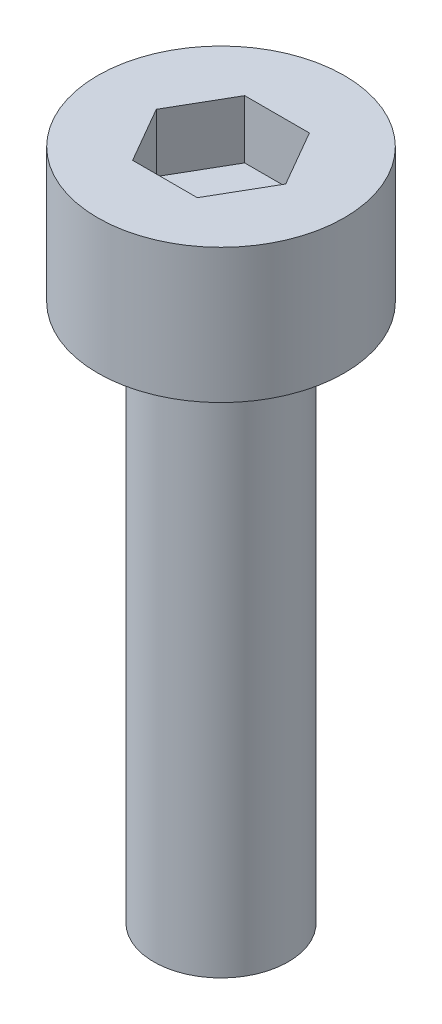
ISO-10303-21;
HEADER;
FILE_DESCRIPTION(('STEP AP214'),'2;1');
FILE_NAME('part.step','',(''),(''),'','','');
FILE_SCHEMA(('AUTOMOTIVE_DESIGN { 1 0 10303 214 1 1 1 1 }'));
ENDSEC;
DATA;
#1=APPLICATION_CONTEXT('core data for automotive mechanical design processes');
#2=APPLICATION_PROTOCOL_DEFINITION('international standard','automotive_design',2000,#1);
#3=PRODUCT_CONTEXT('',#1,'mechanical');
#4=PRODUCT('Part','Part','',(#3));
#5=PRODUCT_RELATED_PRODUCT_CATEGORY('part','',(#4));
#6=PRODUCT_DEFINITION_FORMATION('','',#4);
#7=PRODUCT_DEFINITION_CONTEXT('part definition',#1,'design');
#8=PRODUCT_DEFINITION('design','',#6,#7);
#9=PRODUCT_DEFINITION_SHAPE('','',#8);
#10=(LENGTH_UNIT() NAMED_UNIT(*) SI_UNIT(.MILLI.,.METRE.));
#11=(NAMED_UNIT(*) PLANE_ANGLE_UNIT() SI_UNIT($,.RADIAN.));
#12=(NAMED_UNIT(*) SI_UNIT($,.STERADIAN.) SOLID_ANGLE_UNIT());
#13=UNCERTAINTY_MEASURE_WITH_UNIT(LENGTH_MEASURE(1.E-05),#10,'distance_accuracy_value','');
#14=(GEOMETRIC_REPRESENTATION_CONTEXT(3) GLOBAL_UNCERTAINTY_ASSIGNED_CONTEXT((#13)) GLOBAL_UNIT_ASSIGNED_CONTEXT((#10,
#11,#12)) REPRESENTATION_CONTEXT('',''));
#15=CARTESIAN_POINT('',(0.,0.,0.));
#16=DIRECTION('',(0.,0.,1.));
#17=DIRECTION('',(1.,0.,0.));
#18=AXIS2_PLACEMENT_3D('',#15,#16,#17);
#19=CARTESIAN_POINT('',(0.,3.,0.));
#20=DIRECTION('',(0.,-1.,0.));
#21=DIRECTION('',(0.,0.,-1.));
#22=AXIS2_PLACEMENT_3D('',#19,#20,#21);
#23=CYLINDRICAL_SURFACE('',#22,2.75);
#24=CARTESIAN_POINT('',(0.,3.,0.));
#25=DIRECTION('',(0.,1.,0.));
#26=DIRECTION('',(0.,0.,1.));
#27=AXIS2_PLACEMENT_3D('',#24,#25,#26);
#28=CIRCLE('',#27,2.75);
#29=CARTESIAN_POINT('',(0.,3.,2.75));
#30=VERTEX_POINT('',#29);
#31=EDGE_CURVE('E45',#30,#30,#28,.T.);
#32=ORIENTED_EDGE('',*,*,#31,.F.);
#33=EDGE_LOOP('',(#32));
#34=FACE_BOUND('',#33,.T.);
#35=CARTESIAN_POINT('',(0.,0.,0.));
#36=DIRECTION('',(0.,1.,0.));
#37=DIRECTION('',(0.,0.,1.));
#38=AXIS2_PLACEMENT_3D('',#35,#36,#37);
#39=CIRCLE('',#38,2.75);
#40=CARTESIAN_POINT('',(0.,0.,2.75));
#41=VERTEX_POINT('',#40);
#42=EDGE_CURVE('E40',#41,#41,#39,.T.);
#43=ORIENTED_EDGE('',*,*,#42,.T.);
#44=EDGE_LOOP('',(#43));
#45=FACE_BOUND('',#44,.T.);
#46=ADVANCED_FACE('F37',(#34,#45),#23,.T.);
#47=CARTESIAN_POINT('',(0.,3.,0.));
#48=DIRECTION('',(0.,1.,0.));
#49=DIRECTION('',(0.,0.,1.));
#50=AXIS2_PLACEMENT_3D('',#47,#48,#49);
#51=PLANE('',#50);
#52=DIRECTION('',(0.5,0.,-0.866025403784439));
#53=VECTOR('',#52,1.);
#54=CARTESIAN_POINT('',(0.721687836487032,3.,1.25));
#55=LINE('',#54,#53);
#56=CARTESIAN_POINT('',(0.721687836487032,3.,1.25));
#57=VERTEX_POINT('',#56);
#58=CARTESIAN_POINT('',(1.44337567297406,3.,0.));
#59=VERTEX_POINT('',#58);
#60=EDGE_CURVE('E53',#57,#59,#55,.T.);
#61=ORIENTED_EDGE('',*,*,#60,.F.);
#62=DIRECTION('',(1.,0.,0.));
#63=VECTOR('',#62,1.);
#64=CARTESIAN_POINT('',(-0.721687836487033,3.,1.25));
#65=LINE('',#64,#63);
#66=CARTESIAN_POINT('',(-0.721687836487033,3.,1.25));
#67=VERTEX_POINT('',#66);
#68=EDGE_CURVE('E137',#67,#57,#65,.T.);
#69=ORIENTED_EDGE('',*,*,#68,.F.);
#70=DIRECTION('',(0.5,0.,0.866025403784439));
#71=VECTOR('',#70,1.);
#72=CARTESIAN_POINT('',(-1.44337567297407,3.,0.));
#73=LINE('',#72,#71);
#74=CARTESIAN_POINT('',(-1.44337567297407,3.,0.));
#75=VERTEX_POINT('',#74);
#76=EDGE_CURVE('E135',#75,#67,#73,.T.);
#77=ORIENTED_EDGE('',*,*,#76,.F.);
#78=DIRECTION('',(-0.5,0.,0.866025403784438));
#79=VECTOR('',#78,1.);
#80=CARTESIAN_POINT('',(-0.721687836487033,3.,-1.25));
#81=LINE('',#80,#79);
#82=CARTESIAN_POINT('',(-0.721687836487033,3.,-1.25));
#83=VERTEX_POINT('',#82);
#84=EDGE_CURVE('E101',#83,#75,#81,.T.);
#85=ORIENTED_EDGE('',*,*,#84,.F.);
#86=DIRECTION('',(-1.,0.,0.));
#87=VECTOR('',#86,1.);
#88=CARTESIAN_POINT('',(0.721687836487032,3.,-1.25));
#89=LINE('',#88,#87);
#90=CARTESIAN_POINT('',(0.721687836487032,3.,-1.25));
#91=VERTEX_POINT('',#90);
#92=EDGE_CURVE('E131',#91,#83,#89,.T.);
#93=ORIENTED_EDGE('',*,*,#92,.F.);
#94=DIRECTION('',(-0.5,0.,-0.866025403784439));
#95=VECTOR('',#94,1.);
#96=CARTESIAN_POINT('',(1.44337567297406,3.,0.));
#97=LINE('',#96,#95);
#98=EDGE_CURVE('E127',#59,#91,#97,.T.);
#99=ORIENTED_EDGE('',*,*,#98,.F.);
#100=EDGE_LOOP('',(#61,#69,#77,#85,#93,#99));
#101=FACE_BOUND('',#100,.T.);
#102=ORIENTED_EDGE('',*,*,#31,.T.);
#103=EDGE_LOOP('',(#102));
#104=FACE_BOUND('',#103,.T.);
#105=ADVANCED_FACE('F155',(#101,#104),#51,.T.);
#106=CARTESIAN_POINT('',(0.,0.,0.));
#107=DIRECTION('',(0.,1.,0.));
#108=DIRECTION('',(0.,0.,1.));
#109=AXIS2_PLACEMENT_3D('',#106,#107,#108);
#110=PLANE('',#109);
#111=CARTESIAN_POINT('',(0.,0.,0.));
#112=DIRECTION('',(0.,-1.,0.));
#113=DIRECTION('',(0.,0.,-1.));
#114=AXIS2_PLACEMENT_3D('',#111,#112,#113);
#115=CIRCLE('',#114,1.5);
#116=CARTESIAN_POINT('',(0.,0.,-1.5));
#117=VERTEX_POINT('',#116);
#118=EDGE_CURVE('E11',#117,#117,#115,.T.);
#119=ORIENTED_EDGE('',*,*,#118,.F.);
#120=EDGE_LOOP('',(#119));
#121=FACE_BOUND('',#120,.T.);
#122=ORIENTED_EDGE('',*,*,#42,.F.);
#123=EDGE_LOOP('',(#122));
#124=FACE_BOUND('',#123,.T.);
#125=ADVANCED_FACE('F152',(#121,#124),#110,.F.);
#126=CARTESIAN_POINT('',(0.721687836487032,1.7,1.25));
#127=DIRECTION('',(0.866025403784439,0.,0.5));
#128=DIRECTION('',(0.5,0.,-0.866025403784439));
#129=AXIS2_PLACEMENT_3D('',#126,#127,#128);
#130=PLANE('',#129);
#131=ORIENTED_EDGE('',*,*,#60,.T.);
#132=DIRECTION('',(0.,1.,0.));
#133=VECTOR('',#132,1.);
#134=CARTESIAN_POINT('',(1.44337567297406,1.7,0.));
#135=LINE('',#134,#133);
#136=CARTESIAN_POINT('',(1.44337567297406,1.7,0.));
#137=VERTEX_POINT('',#136);
#138=EDGE_CURVE('E83',#137,#59,#135,.T.);
#139=ORIENTED_EDGE('',*,*,#138,.F.);
#140=DIRECTION('',(0.5,0.,-0.866025403784439));
#141=VECTOR('',#140,1.);
#142=CARTESIAN_POINT('',(0.721687836487032,1.7,1.25));
#143=LINE('',#142,#141);
#144=CARTESIAN_POINT('',(0.721687836487032,1.7,1.25));
#145=VERTEX_POINT('',#144);
#146=EDGE_CURVE('E139',#145,#137,#143,.T.);
#147=ORIENTED_EDGE('',*,*,#146,.F.);
#148=DIRECTION('',(0.,1.,0.));
#149=VECTOR('',#148,1.);
#150=CARTESIAN_POINT('',(0.721687836487032,1.7,1.25));
#151=LINE('',#150,#149);
#152=EDGE_CURVE('E61',#145,#57,#151,.T.);
#153=ORIENTED_EDGE('',*,*,#152,.T.);
#154=EDGE_LOOP('',(#131,#139,#147,#153));
#155=FACE_BOUND('',#154,.T.);
#156=ADVANCED_FACE('F154',(#155),#130,.F.);
#157=CARTESIAN_POINT('',(-0.721687836487033,1.7,1.25));
#158=DIRECTION('',(0.,0.,1.));
#159=DIRECTION('',(1.,0.,0.));
#160=AXIS2_PLACEMENT_3D('',#157,#158,#159);
#161=PLANE('',#160);
#162=ORIENTED_EDGE('',*,*,#68,.T.);
#163=ORIENTED_EDGE('',*,*,#152,.F.);
#164=DIRECTION('',(1.,0.,0.));
#165=VECTOR('',#164,1.);
#166=CARTESIAN_POINT('',(-0.721687836487033,1.7,1.25));
#167=LINE('',#166,#165);
#168=CARTESIAN_POINT('',(-0.721687836487033,1.7,1.25));
#169=VERTEX_POINT('',#168);
#170=EDGE_CURVE('E113',#169,#145,#167,.T.);
#171=ORIENTED_EDGE('',*,*,#170,.F.);
#172=DIRECTION('',(0.,1.,0.));
#173=VECTOR('',#172,1.);
#174=CARTESIAN_POINT('',(-0.721687836487033,1.7,1.25));
#175=LINE('',#174,#173);
#176=EDGE_CURVE('E105',#169,#67,#175,.T.);
#177=ORIENTED_EDGE('',*,*,#176,.T.);
#178=EDGE_LOOP('',(#162,#163,#171,#177));
#179=FACE_BOUND('',#178,.T.);
#180=ADVANCED_FACE('F161',(#179),#161,.F.);
#181=CARTESIAN_POINT('',(-1.44337567297407,1.7,0.));
#182=DIRECTION('',(-0.866025403784439,0.,0.5));
#183=DIRECTION('',(0.5,0.,0.866025403784439));
#184=AXIS2_PLACEMENT_3D('',#181,#182,#183);
#185=PLANE('',#184);
#186=ORIENTED_EDGE('',*,*,#76,.T.);
#187=ORIENTED_EDGE('',*,*,#176,.F.);
#188=DIRECTION('',(0.5,0.,0.866025403784439));
#189=VECTOR('',#188,1.);
#190=CARTESIAN_POINT('',(-1.44337567297407,1.7,0.));
#191=LINE('',#190,#189);
#192=CARTESIAN_POINT('',(-1.44337567297407,1.7,0.));
#193=VERTEX_POINT('',#192);
#194=EDGE_CURVE('E109',#193,#169,#191,.T.);
#195=ORIENTED_EDGE('',*,*,#194,.F.);
#196=DIRECTION('',(0.,1.,0.));
#197=VECTOR('',#196,1.);
#198=CARTESIAN_POINT('',(-1.44337567297407,1.7,0.));
#199=LINE('',#198,#197);
#200=EDGE_CURVE('E94',#193,#75,#199,.T.);
#201=ORIENTED_EDGE('',*,*,#200,.T.);
#202=EDGE_LOOP('',(#186,#187,#195,#201));
#203=FACE_BOUND('',#202,.T.);
#204=ADVANCED_FACE('F110',(#203),#185,.F.);
#205=CARTESIAN_POINT('',(-0.721687836487033,1.7,-1.25));
#206=DIRECTION('',(-0.866025403784439,0.,-0.5));
#207=DIRECTION('',(-0.5,0.,0.866025403784439));
#208=AXIS2_PLACEMENT_3D('',#205,#206,#207);
#209=PLANE('',#208);
#210=ORIENTED_EDGE('',*,*,#84,.T.);
#211=ORIENTED_EDGE('',*,*,#200,.F.);
#212=DIRECTION('',(-0.5,0.,0.866025403784438));
#213=VECTOR('',#212,1.);
#214=CARTESIAN_POINT('',(-0.721687836487033,1.7,-1.25));
#215=LINE('',#214,#213);
#216=CARTESIAN_POINT('',(-0.721687836487033,1.7,-1.25));
#217=VERTEX_POINT('',#216);
#218=EDGE_CURVE('E98',#217,#193,#215,.T.);
#219=ORIENTED_EDGE('',*,*,#218,.F.);
#220=DIRECTION('',(0.,1.,0.));
#221=VECTOR('',#220,1.);
#222=CARTESIAN_POINT('',(-0.721687836487033,1.7,-1.25));
#223=LINE('',#222,#221);
#224=EDGE_CURVE('E106',#217,#83,#223,.T.);
#225=ORIENTED_EDGE('',*,*,#224,.T.);
#226=EDGE_LOOP('',(#210,#211,#219,#225));
#227=FACE_BOUND('',#226,.T.);
#228=ADVANCED_FACE('F96',(#227),#209,.F.);
#229=CARTESIAN_POINT('',(0.721687836487032,1.7,-1.25));
#230=DIRECTION('',(0.,0.,-1.));
#231=DIRECTION('',(-1.,0.,0.));
#232=AXIS2_PLACEMENT_3D('',#229,#230,#231);
#233=PLANE('',#232);
#234=ORIENTED_EDGE('',*,*,#92,.T.);
#235=ORIENTED_EDGE('',*,*,#224,.F.);
#236=DIRECTION('',(-1.,0.,0.));
#237=VECTOR('',#236,1.);
#238=CARTESIAN_POINT('',(0.721687836487032,1.7,-1.25));
#239=LINE('',#238,#237);
#240=CARTESIAN_POINT('',(0.721687836487032,1.7,-1.25));
#241=VERTEX_POINT('',#240);
#242=EDGE_CURVE('E119',#241,#217,#239,.T.);
#243=ORIENTED_EDGE('',*,*,#242,.F.);
#244=DIRECTION('',(0.,1.,0.));
#245=VECTOR('',#244,1.);
#246=CARTESIAN_POINT('',(0.721687836487032,1.7,-1.25));
#247=LINE('',#246,#245);
#248=EDGE_CURVE('E143',#241,#91,#247,.T.);
#249=ORIENTED_EDGE('',*,*,#248,.T.);
#250=EDGE_LOOP('',(#234,#235,#243,#249));
#251=FACE_BOUND('',#250,.T.);
#252=ADVANCED_FACE('F206',(#251),#233,.F.);
#253=CARTESIAN_POINT('',(1.44337567297406,1.7,0.));
#254=DIRECTION('',(0.866025403784439,0.,-0.5));
#255=DIRECTION('',(-0.5,0.,-0.866025403784439));
#256=AXIS2_PLACEMENT_3D('',#253,#254,#255);
#257=PLANE('',#256);
#258=ORIENTED_EDGE('',*,*,#98,.T.);
#259=ORIENTED_EDGE('',*,*,#248,.F.);
#260=DIRECTION('',(-0.5,0.,-0.866025403784439));
#261=VECTOR('',#260,1.);
#262=CARTESIAN_POINT('',(1.44337567297406,1.7,0.));
#263=LINE('',#262,#261);
#264=EDGE_CURVE('E121',#137,#241,#263,.T.);
#265=ORIENTED_EDGE('',*,*,#264,.F.);
#266=ORIENTED_EDGE('',*,*,#138,.T.);
#267=EDGE_LOOP('',(#258,#259,#265,#266));
#268=FACE_BOUND('',#267,.T.);
#269=ADVANCED_FACE('F215',(#268),#257,.F.);
#270=CARTESIAN_POINT('',(0.,1.7,0.));
#271=DIRECTION('',(0.,1.,0.));
#272=DIRECTION('',(0.,0.,1.));
#273=AXIS2_PLACEMENT_3D('',#270,#271,#272);
#274=PLANE('',#273);
#275=ORIENTED_EDGE('',*,*,#146,.T.);
#276=ORIENTED_EDGE('',*,*,#264,.T.);
#277=ORIENTED_EDGE('',*,*,#242,.T.);
#278=ORIENTED_EDGE('',*,*,#218,.T.);
#279=ORIENTED_EDGE('',*,*,#194,.T.);
#280=ORIENTED_EDGE('',*,*,#170,.T.);
#281=EDGE_LOOP('',(#275,#276,#277,#278,#279,#280));
#282=FACE_BOUND('',#281,.T.);
#283=ADVANCED_FACE('F116',(#282),#274,.T.);
#284=CARTESIAN_POINT('',(0.,-12.,0.));
#285=DIRECTION('',(0.,1.,0.));
#286=DIRECTION('',(0.,0.,1.));
#287=AXIS2_PLACEMENT_3D('',#284,#285,#286);
#288=CYLINDRICAL_SURFACE('',#287,1.5);
#289=CARTESIAN_POINT('',(0.,-12.,0.));
#290=DIRECTION('',(0.,-1.,0.));
#291=DIRECTION('',(0.,0.,-1.));
#292=AXIS2_PLACEMENT_3D('',#289,#290,#291);
#293=CIRCLE('',#292,1.5);
#294=CARTESIAN_POINT('',(0.,-12.,-1.5));
#295=VERTEX_POINT('',#294);
#296=EDGE_CURVE('E128',#295,#295,#293,.T.);
#297=ORIENTED_EDGE('',*,*,#296,.F.);
#298=EDGE_LOOP('',(#297));
#299=FACE_BOUND('',#298,.T.);
#300=ORIENTED_EDGE('',*,*,#118,.T.);
#301=EDGE_LOOP('',(#300));
#302=FACE_BOUND('',#301,.T.);
#303=ADVANCED_FACE('F233',(#299,#302),#288,.T.);
#304=CARTESIAN_POINT('',(0.,-12.,0.));
#305=DIRECTION('',(0.,-1.,0.));
#306=DIRECTION('',(0.,0.,-1.));
#307=AXIS2_PLACEMENT_3D('',#304,#305,#306);
#308=PLANE('',#307);
#309=ORIENTED_EDGE('',*,*,#296,.T.);
#310=EDGE_LOOP('',(#309));
#311=FACE_BOUND('',#310,.T.);
#312=ADVANCED_FACE('F247',(#311),#308,.T.);
#313=CLOSED_SHELL('',(#46,#105,#125,#156,#180,#204,#228,#252,#269,#283,#303,#312));
#314=MANIFOLD_SOLID_BREP('B2',#313);
#315=ADVANCED_BREP_SHAPE_REPRESENTATION('',(#18,#314),#14);
#316=SHAPE_DEFINITION_REPRESENTATION(#9,#315);
ENDSEC;
END-ISO-10303-21;
